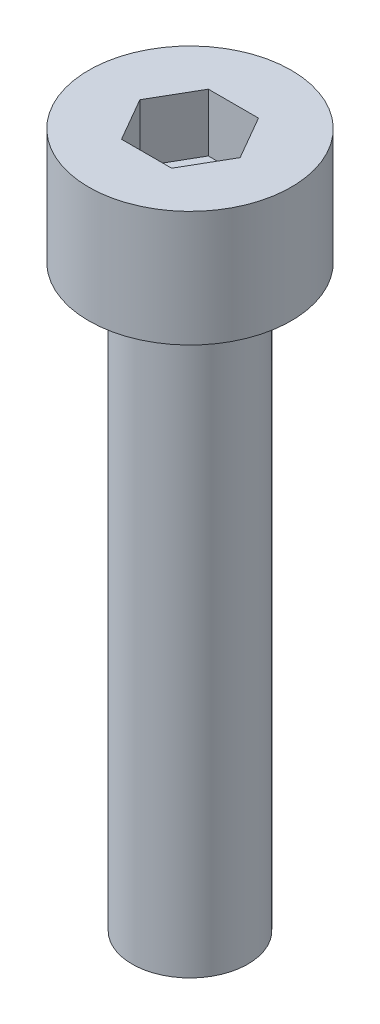
ISO-10303-21;
HEADER;
FILE_DESCRIPTION(('STEP AP214'),'2;1');
FILE_NAME('part.step','',(''),(''),'','','');
FILE_SCHEMA(('AUTOMOTIVE_DESIGN { 1 0 10303 214 1 1 1 1 }'));
ENDSEC;
DATA;
#1=APPLICATION_CONTEXT('core data for automotive mechanical design processes');
#2=APPLICATION_PROTOCOL_DEFINITION('international standard','automotive_design',2000,#1);
#3=PRODUCT_CONTEXT('',#1,'mechanical');
#4=PRODUCT('Part','Part','',(#3));
#5=PRODUCT_RELATED_PRODUCT_CATEGORY('part','',(#4));
#6=PRODUCT_DEFINITION_FORMATION('','',#4);
#7=PRODUCT_DEFINITION_CONTEXT('part definition',#1,'design');
#8=PRODUCT_DEFINITION('design','',#6,#7);
#9=PRODUCT_DEFINITION_SHAPE('','',#8);
#10=(LENGTH_UNIT() NAMED_UNIT(*) SI_UNIT(.MILLI.,.METRE.));
#11=(NAMED_UNIT(*) PLANE_ANGLE_UNIT() SI_UNIT($,.RADIAN.));
#12=(NAMED_UNIT(*) SI_UNIT($,.STERADIAN.) SOLID_ANGLE_UNIT());
#13=UNCERTAINTY_MEASURE_WITH_UNIT(LENGTH_MEASURE(1.E-05),#10,'distance_accuracy_value','');
#14=(GEOMETRIC_REPRESENTATION_CONTEXT(3) GLOBAL_UNCERTAINTY_ASSIGNED_CONTEXT((#13)) GLOBAL_UNIT_ASSIGNED_CONTEXT((#10,
#11,#12)) REPRESENTATION_CONTEXT('',''));
#15=CARTESIAN_POINT('',(0.,0.,0.));
#16=DIRECTION('',(0.,0.,1.));
#17=DIRECTION('',(1.,0.,0.));
#18=AXIS2_PLACEMENT_3D('',#15,#16,#17);
#19=CARTESIAN_POINT('',(0.,4.,0.));
#20=DIRECTION('',(0.,-1.,0.));
#21=DIRECTION('',(0.,0.,-1.));
#22=AXIS2_PLACEMENT_3D('',#19,#20,#21);
#23=CYLINDRICAL_SURFACE('',#22,3.5);
#24=CARTESIAN_POINT('',(0.,4.,0.));
#25=DIRECTION('',(0.,1.,0.));
#26=DIRECTION('',(0.,0.,1.));
#27=AXIS2_PLACEMENT_3D('',#24,#25,#26);
#28=CIRCLE('',#27,3.5);
#29=CARTESIAN_POINT('',(0.,4.,3.5));
#30=VERTEX_POINT('',#29);
#31=EDGE_CURVE('E43',#30,#30,#28,.T.);
#32=ORIENTED_EDGE('',*,*,#31,.F.);
#33=EDGE_LOOP('',(#32));
#34=FACE_BOUND('',#33,.T.);
#35=CARTESIAN_POINT('',(0.,0.,0.));
#36=DIRECTION('',(0.,1.,0.));
#37=DIRECTION('',(0.,0.,1.));
#38=AXIS2_PLACEMENT_3D('',#35,#36,#37);
#39=CIRCLE('',#38,3.5);
#40=CARTESIAN_POINT('',(0.,0.,3.5));
#41=VERTEX_POINT('',#40);
#42=EDGE_CURVE('E38',#41,#41,#39,.T.);
#43=ORIENTED_EDGE('',*,*,#42,.T.);
#44=EDGE_LOOP('',(#43));
#45=FACE_BOUND('',#44,.T.);
#46=ADVANCED_FACE('F35',(#34,#45),#23,.T.);
#47=CARTESIAN_POINT('',(0.,4.,0.));
#48=DIRECTION('',(0.,1.,0.));
#49=DIRECTION('',(0.,0.,1.));
#50=AXIS2_PLACEMENT_3D('',#47,#48,#49);
#51=PLANE('',#50);
#52=DIRECTION('',(0.5,0.,-0.866025403784439));
#53=VECTOR('',#52,1.);
#54=CARTESIAN_POINT('',(0.866025403784438,4.,1.5));
#55=LINE('',#54,#53);
#56=CARTESIAN_POINT('',(0.866025403784438,4.,1.5));
#57=VERTEX_POINT('',#56);
#58=CARTESIAN_POINT('',(1.73205080756888,4.,0.));
#59=VERTEX_POINT('',#58);
#60=EDGE_CURVE('E51',#57,#59,#55,.T.);
#61=ORIENTED_EDGE('',*,*,#60,.F.);
#62=DIRECTION('',(1.,0.,0.));
#63=VECTOR('',#62,1.);
#64=CARTESIAN_POINT('',(-0.866025403784439,4.,1.5));
#65=LINE('',#64,#63);
#66=CARTESIAN_POINT('',(-0.866025403784439,4.,1.5));
#67=VERTEX_POINT('',#66);
#68=EDGE_CURVE('E135',#67,#57,#65,.T.);
#69=ORIENTED_EDGE('',*,*,#68,.F.);
#70=DIRECTION('',(0.5,0.,0.866025403784438));
#71=VECTOR('',#70,1.);
#72=CARTESIAN_POINT('',(-1.73205080756888,4.,0.));
#73=LINE('',#72,#71);
#74=CARTESIAN_POINT('',(-1.73205080756888,4.,0.));
#75=VERTEX_POINT('',#74);
#76=EDGE_CURVE('E133',#75,#67,#73,.T.);
#77=ORIENTED_EDGE('',*,*,#76,.F.);
#78=DIRECTION('',(-0.5,0.,0.866025403784439));
#79=VECTOR('',#78,1.);
#80=CARTESIAN_POINT('',(-0.866025403784439,4.,-1.5));
#81=LINE('',#80,#79);
#82=CARTESIAN_POINT('',(-0.866025403784439,4.,-1.5));
#83=VERTEX_POINT('',#82);
#84=EDGE_CURVE('E99',#83,#75,#81,.T.);
#85=ORIENTED_EDGE('',*,*,#84,.F.);
#86=DIRECTION('',(-1.,0.,0.));
#87=VECTOR('',#86,1.);
#88=CARTESIAN_POINT('',(0.866025403784438,4.,-1.5));
#89=LINE('',#88,#87);
#90=CARTESIAN_POINT('',(0.866025403784438,4.,-1.5));
#91=VERTEX_POINT('',#90);
#92=EDGE_CURVE('E129',#91,#83,#89,.T.);
#93=ORIENTED_EDGE('',*,*,#92,.F.);
#94=DIRECTION('',(-0.5,0.,-0.866025403784439));
#95=VECTOR('',#94,1.);
#96=CARTESIAN_POINT('',(1.73205080756888,4.,0.));
#97=LINE('',#96,#95);
#98=EDGE_CURVE('E125',#59,#91,#97,.T.);
#99=ORIENTED_EDGE('',*,*,#98,.F.);
#100=EDGE_LOOP('',(#61,#69,#77,#85,#93,#99));
#101=FACE_BOUND('',#100,.T.);
#102=ORIENTED_EDGE('',*,*,#31,.T.);
#103=EDGE_LOOP('',(#102));
#104=FACE_BOUND('',#103,.T.);
#105=ADVANCED_FACE('F153',(#101,#104),#51,.T.);
#106=CARTESIAN_POINT('',(0.,0.,0.));
#107=DIRECTION('',(0.,1.,0.));
#108=DIRECTION('',(0.,0.,1.));
#109=AXIS2_PLACEMENT_3D('',#106,#107,#108);
#110=PLANE('',#109);
#111=CARTESIAN_POINT('',(0.,0.,0.));
#112=DIRECTION('',(0.,-1.,0.));
#113=DIRECTION('',(0.,0.,-1.));
#114=AXIS2_PLACEMENT_3D('',#111,#112,#113);
#115=CIRCLE('',#114,2.);
#116=CARTESIAN_POINT('',(0.,0.,-2.));
#117=VERTEX_POINT('',#116);
#118=EDGE_CURVE('E11',#117,#117,#115,.T.);
#119=ORIENTED_EDGE('',*,*,#118,.F.);
#120=EDGE_LOOP('',(#119));
#121=FACE_BOUND('',#120,.T.);
#122=ORIENTED_EDGE('',*,*,#42,.F.);
#123=EDGE_LOOP('',(#122));
#124=FACE_BOUND('',#123,.T.);
#125=ADVANCED_FACE('F150',(#121,#124),#110,.F.);
#126=CARTESIAN_POINT('',(0.866025403784438,2.,1.5));
#127=DIRECTION('',(0.866025403784439,0.,0.5));
#128=DIRECTION('',(0.5,0.,-0.866025403784439));
#129=AXIS2_PLACEMENT_3D('',#126,#127,#128);
#130=PLANE('',#129);
#131=ORIENTED_EDGE('',*,*,#60,.T.);
#132=DIRECTION('',(0.,1.,0.));
#133=VECTOR('',#132,1.);
#134=CARTESIAN_POINT('',(1.73205080756888,2.,0.));
#135=LINE('',#134,#133);
#136=CARTESIAN_POINT('',(1.73205080756888,2.,0.));
#137=VERTEX_POINT('',#136);
#138=EDGE_CURVE('E81',#137,#59,#135,.T.);
#139=ORIENTED_EDGE('',*,*,#138,.F.);
#140=DIRECTION('',(0.5,0.,-0.866025403784439));
#141=VECTOR('',#140,1.);
#142=CARTESIAN_POINT('',(0.866025403784438,2.,1.5));
#143=LINE('',#142,#141);
#144=CARTESIAN_POINT('',(0.866025403784438,2.,1.5));
#145=VERTEX_POINT('',#144);
#146=EDGE_CURVE('E137',#145,#137,#143,.T.);
#147=ORIENTED_EDGE('',*,*,#146,.F.);
#148=DIRECTION('',(0.,1.,0.));
#149=VECTOR('',#148,1.);
#150=CARTESIAN_POINT('',(0.866025403784438,2.,1.5));
#151=LINE('',#150,#149);
#152=EDGE_CURVE('E59',#145,#57,#151,.T.);
#153=ORIENTED_EDGE('',*,*,#152,.T.);
#154=EDGE_LOOP('',(#131,#139,#147,#153));
#155=FACE_BOUND('',#154,.T.);
#156=ADVANCED_FACE('F152',(#155),#130,.F.);
#157=CARTESIAN_POINT('',(-0.866025403784439,2.,1.5));
#158=DIRECTION('',(0.,0.,1.));
#159=DIRECTION('',(1.,0.,0.));
#160=AXIS2_PLACEMENT_3D('',#157,#158,#159);
#161=PLANE('',#160);
#162=ORIENTED_EDGE('',*,*,#68,.T.);
#163=ORIENTED_EDGE('',*,*,#152,.F.);
#164=DIRECTION('',(1.,0.,0.));
#165=VECTOR('',#164,1.);
#166=CARTESIAN_POINT('',(-0.866025403784439,2.,1.5));
#167=LINE('',#166,#165);
#168=CARTESIAN_POINT('',(-0.866025403784439,2.,1.5));
#169=VERTEX_POINT('',#168);
#170=EDGE_CURVE('E111',#169,#145,#167,.T.);
#171=ORIENTED_EDGE('',*,*,#170,.F.);
#172=DIRECTION('',(0.,1.,0.));
#173=VECTOR('',#172,1.);
#174=CARTESIAN_POINT('',(-0.866025403784439,2.,1.5));
#175=LINE('',#174,#173);
#176=EDGE_CURVE('E103',#169,#67,#175,.T.);
#177=ORIENTED_EDGE('',*,*,#176,.T.);
#178=EDGE_LOOP('',(#162,#163,#171,#177));
#179=FACE_BOUND('',#178,.T.);
#180=ADVANCED_FACE('F159',(#179),#161,.F.);
#181=CARTESIAN_POINT('',(-1.73205080756888,2.,0.));
#182=DIRECTION('',(-0.866025403784439,0.,0.5));
#183=DIRECTION('',(0.5,0.,0.866025403784438));
#184=AXIS2_PLACEMENT_3D('',#181,#182,#183);
#185=PLANE('',#184);
#186=ORIENTED_EDGE('',*,*,#76,.T.);
#187=ORIENTED_EDGE('',*,*,#176,.F.);
#188=DIRECTION('',(0.5,0.,0.866025403784438));
#189=VECTOR('',#188,1.);
#190=CARTESIAN_POINT('',(-1.73205080756888,2.,0.));
#191=LINE('',#190,#189);
#192=CARTESIAN_POINT('',(-1.73205080756888,2.,0.));
#193=VERTEX_POINT('',#192);
#194=EDGE_CURVE('E107',#193,#169,#191,.T.);
#195=ORIENTED_EDGE('',*,*,#194,.F.);
#196=DIRECTION('',(0.,1.,0.));
#197=VECTOR('',#196,1.);
#198=CARTESIAN_POINT('',(-1.73205080756888,2.,0.));
#199=LINE('',#198,#197);
#200=EDGE_CURVE('E92',#193,#75,#199,.T.);
#201=ORIENTED_EDGE('',*,*,#200,.T.);
#202=EDGE_LOOP('',(#186,#187,#195,#201));
#203=FACE_BOUND('',#202,.T.);
#204=ADVANCED_FACE('F108',(#203),#185,.F.);
#205=CARTESIAN_POINT('',(-0.866025403784439,2.,-1.5));
#206=DIRECTION('',(-0.866025403784439,0.,-0.5));
#207=DIRECTION('',(-0.5,0.,0.866025403784439));
#208=AXIS2_PLACEMENT_3D('',#205,#206,#207);
#209=PLANE('',#208);
#210=ORIENTED_EDGE('',*,*,#84,.T.);
#211=ORIENTED_EDGE('',*,*,#200,.F.);
#212=DIRECTION('',(-0.5,0.,0.866025403784439));
#213=VECTOR('',#212,1.);
#214=CARTESIAN_POINT('',(-0.866025403784439,2.,-1.5));
#215=LINE('',#214,#213);
#216=CARTESIAN_POINT('',(-0.866025403784439,2.,-1.5));
#217=VERTEX_POINT('',#216);
#218=EDGE_CURVE('E96',#217,#193,#215,.T.);
#219=ORIENTED_EDGE('',*,*,#218,.F.);
#220=DIRECTION('',(0.,1.,0.));
#221=VECTOR('',#220,1.);
#222=CARTESIAN_POINT('',(-0.866025403784439,2.,-1.5));
#223=LINE('',#222,#221);
#224=EDGE_CURVE('E104',#217,#83,#223,.T.);
#225=ORIENTED_EDGE('',*,*,#224,.T.);
#226=EDGE_LOOP('',(#210,#211,#219,#225));
#227=FACE_BOUND('',#226,.T.);
#228=ADVANCED_FACE('F94',(#227),#209,.F.);
#229=CARTESIAN_POINT('',(0.866025403784438,2.,-1.5));
#230=DIRECTION('',(0.,0.,-1.));
#231=DIRECTION('',(-1.,0.,0.));
#232=AXIS2_PLACEMENT_3D('',#229,#230,#231);
#233=PLANE('',#232);
#234=ORIENTED_EDGE('',*,*,#92,.T.);
#235=ORIENTED_EDGE('',*,*,#224,.F.);
#236=DIRECTION('',(-1.,0.,0.));
#237=VECTOR('',#236,1.);
#238=CARTESIAN_POINT('',(0.866025403784438,2.,-1.5));
#239=LINE('',#238,#237);
#240=CARTESIAN_POINT('',(0.866025403784438,2.,-1.5));
#241=VERTEX_POINT('',#240);
#242=EDGE_CURVE('E117',#241,#217,#239,.T.);
#243=ORIENTED_EDGE('',*,*,#242,.F.);
#244=DIRECTION('',(0.,1.,0.));
#245=VECTOR('',#244,1.);
#246=CARTESIAN_POINT('',(0.866025403784438,2.,-1.5));
#247=LINE('',#246,#245);
#248=EDGE_CURVE('E141',#241,#91,#247,.T.);
#249=ORIENTED_EDGE('',*,*,#248,.T.);
#250=EDGE_LOOP('',(#234,#235,#243,#249));
#251=FACE_BOUND('',#250,.T.);
#252=ADVANCED_FACE('F204',(#251),#233,.F.);
#253=CARTESIAN_POINT('',(1.73205080756888,2.,0.));
#254=DIRECTION('',(0.866025403784439,0.,-0.5));
#255=DIRECTION('',(-0.5,0.,-0.866025403784439));
#256=AXIS2_PLACEMENT_3D('',#253,#254,#255);
#257=PLANE('',#256);
#258=ORIENTED_EDGE('',*,*,#98,.T.);
#259=ORIENTED_EDGE('',*,*,#248,.F.);
#260=DIRECTION('',(-0.5,0.,-0.866025403784439));
#261=VECTOR('',#260,1.);
#262=CARTESIAN_POINT('',(1.73205080756888,2.,0.));
#263=LINE('',#262,#261);
#264=EDGE_CURVE('E119',#137,#241,#263,.T.);
#265=ORIENTED_EDGE('',*,*,#264,.F.);
#266=ORIENTED_EDGE('',*,*,#138,.T.);
#267=EDGE_LOOP('',(#258,#259,#265,#266));
#268=FACE_BOUND('',#267,.T.);
#269=ADVANCED_FACE('F213',(#268),#257,.F.);
#270=CARTESIAN_POINT('',(0.,2.,0.));
#271=DIRECTION('',(0.,1.,0.));
#272=DIRECTION('',(0.,0.,1.));
#273=AXIS2_PLACEMENT_3D('',#270,#271,#272);
#274=PLANE('',#273);
#275=ORIENTED_EDGE('',*,*,#146,.T.);
#276=ORIENTED_EDGE('',*,*,#264,.T.);
#277=ORIENTED_EDGE('',*,*,#242,.T.);
#278=ORIENTED_EDGE('',*,*,#218,.T.);
#279=ORIENTED_EDGE('',*,*,#194,.T.);
#280=ORIENTED_EDGE('',*,*,#170,.T.);
#281=EDGE_LOOP('',(#275,#276,#277,#278,#279,#280));
#282=FACE_BOUND('',#281,.T.);
#283=ADVANCED_FACE('F114',(#282),#274,.T.);
#284=CARTESIAN_POINT('',(0.,-20.,0.));
#285=DIRECTION('',(0.,1.,0.));
#286=DIRECTION('',(0.,0.,1.));
#287=AXIS2_PLACEMENT_3D('',#284,#285,#286);
#288=CYLINDRICAL_SURFACE('',#287,2.);
#289=CARTESIAN_POINT('',(0.,-20.,0.));
#290=DIRECTION('',(0.,-1.,0.));
#291=DIRECTION('',(0.,0.,-1.));
#292=AXIS2_PLACEMENT_3D('',#289,#290,#291);
#293=CIRCLE('',#292,2.);
#294=CARTESIAN_POINT('',(0.,-20.,-2.));
#295=VERTEX_POINT('',#294);
#296=EDGE_CURVE('E126',#295,#295,#293,.T.);
#297=ORIENTED_EDGE('',*,*,#296,.F.);
#298=EDGE_LOOP('',(#297));
#299=FACE_BOUND('',#298,.T.);
#300=ORIENTED_EDGE('',*,*,#118,.T.);
#301=EDGE_LOOP('',(#300));
#302=FACE_BOUND('',#301,.T.);
#303=ADVANCED_FACE('F231',(#299,#302),#288,.T.);
#304=CARTESIAN_POINT('',(0.,-20.,0.));
#305=DIRECTION('',(0.,-1.,0.));
#306=DIRECTION('',(0.,0.,-1.));
#307=AXIS2_PLACEMENT_3D('',#304,#305,#306);
#308=PLANE('',#307);
#309=ORIENTED_EDGE('',*,*,#296,.T.);
#310=EDGE_LOOP('',(#309));
#311=FACE_BOUND('',#310,.T.);
#312=ADVANCED_FACE('F244',(#311),#308,.T.);
#313=CLOSED_SHELL('',(#46,#105,#125,#156,#180,#204,#228,#252,#269,#283,#303,#312));
#314=MANIFOLD_SOLID_BREP('B2',#313);
#315=ADVANCED_BREP_SHAPE_REPRESENTATION('',(#18,#314),#14);
#316=SHAPE_DEFINITION_REPRESENTATION(#9,#315);
ENDSEC;
END-ISO-10303-21;
